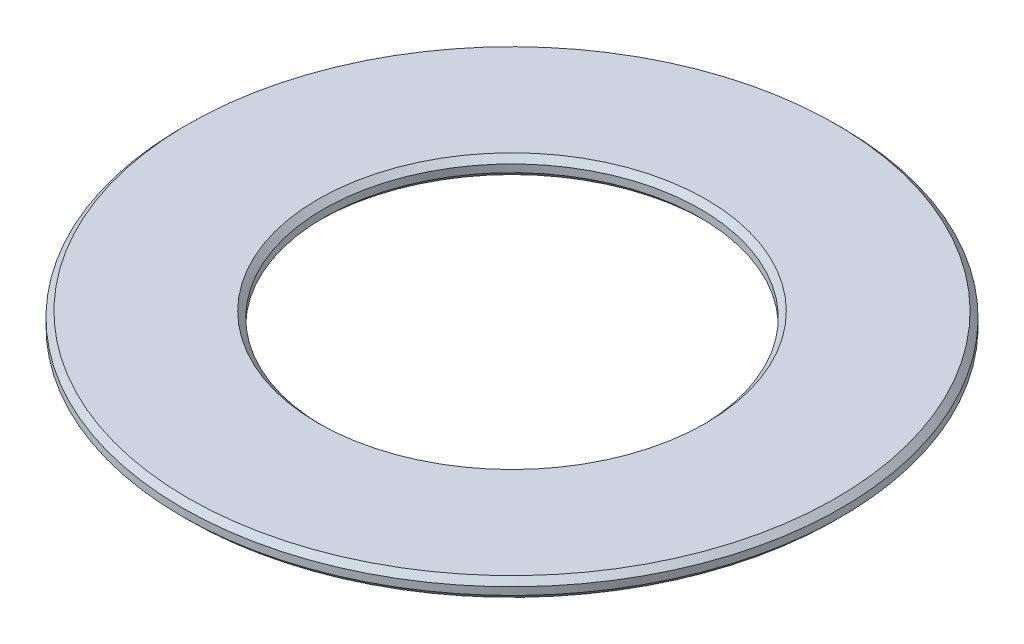
ISO-10303-21;
HEADER;
FILE_DESCRIPTION(('STEP AP214'),'2;1');
FILE_NAME('part.step','',(''),(''),'','','');
FILE_SCHEMA(('AUTOMOTIVE_DESIGN { 1 0 10303 214 1 1 1 1 }'));
ENDSEC;
DATA;
#1=APPLICATION_CONTEXT('core data for automotive mechanical design processes');
#2=APPLICATION_PROTOCOL_DEFINITION('international standard','automotive_design',2000,#1);
#3=PRODUCT_CONTEXT('',#1,'mechanical');
#4=PRODUCT('Part','Part','',(#3));
#5=PRODUCT_RELATED_PRODUCT_CATEGORY('part','',(#4));
#6=PRODUCT_DEFINITION_FORMATION('','',#4);
#7=PRODUCT_DEFINITION_CONTEXT('part definition',#1,'design');
#8=PRODUCT_DEFINITION('design','',#6,#7);
#9=PRODUCT_DEFINITION_SHAPE('','',#8);
#10=(LENGTH_UNIT() NAMED_UNIT(*) SI_UNIT(.MILLI.,.METRE.));
#11=(NAMED_UNIT(*) PLANE_ANGLE_UNIT() SI_UNIT($,.RADIAN.));
#12=(NAMED_UNIT(*) SI_UNIT($,.STERADIAN.) SOLID_ANGLE_UNIT());
#13=UNCERTAINTY_MEASURE_WITH_UNIT(LENGTH_MEASURE(1.E-05),#10,'distance_accuracy_value','');
#14=(GEOMETRIC_REPRESENTATION_CONTEXT(3) GLOBAL_UNCERTAINTY_ASSIGNED_CONTEXT((#13)) GLOBAL_UNIT_ASSIGNED_CONTEXT((#10,
#11,#12)) REPRESENTATION_CONTEXT('',''));
#15=CARTESIAN_POINT('',(0.,0.,0.));
#16=DIRECTION('',(0.,0.,1.));
#17=DIRECTION('',(1.,0.,0.));
#18=AXIS2_PLACEMENT_3D('',#15,#16,#17);
#19=CARTESIAN_POINT('',(0.,0.5,0.));
#20=DIRECTION('',(0.,1.,0.));
#21=DIRECTION('',(0.,0.,1.));
#22=AXIS2_PLACEMENT_3D('',#19,#20,#21);
#23=PLANE('',#22);
#24=CARTESIAN_POINT('',(0.,0.5,0.));
#25=DIRECTION('',(0.,1.,0.));
#26=DIRECTION('',(0.,0.,1.));
#27=AXIS2_PLACEMENT_3D('',#24,#25,#26);
#28=CIRCLE('',#27,17.2);
#29=CARTESIAN_POINT('',(0.,0.5,17.2));
#30=VERTEX_POINT('',#29);
#31=EDGE_CURVE('E40',#30,#30,#28,.T.);
#32=ORIENTED_EDGE('',*,*,#31,.T.);
#33=EDGE_LOOP('',(#32));
#34=FACE_BOUND('',#33,.T.);
#35=CARTESIAN_POINT('',(0.,0.5,0.));
#36=DIRECTION('',(0.,1.,0.));
#37=DIRECTION('',(0.,0.,1.));
#38=AXIS2_PLACEMENT_3D('',#35,#36,#37);
#39=CIRCLE('',#38,10.3);
#40=CARTESIAN_POINT('',(0.,0.5,10.3));
#41=VERTEX_POINT('',#40);
#42=EDGE_CURVE('E44',#41,#41,#39,.F.);
#43=ORIENTED_EDGE('',*,*,#42,.T.);
#44=EDGE_LOOP('',(#43));
#45=FACE_BOUND('',#44,.T.);
#46=ADVANCED_FACE('F29',(#34,#45),#23,.T.);
#47=CARTESIAN_POINT('',(0.,-0.5,0.));
#48=DIRECTION('',(0.,1.,0.));
#49=DIRECTION('',(0.,0.,1.));
#50=AXIS2_PLACEMENT_3D('',#47,#48,#49);
#51=PLANE('',#50);
#52=CARTESIAN_POINT('',(0.,-0.5,0.));
#53=DIRECTION('',(0.,1.,0.));
#54=DIRECTION('',(0.,0.,1.));
#55=AXIS2_PLACEMENT_3D('',#52,#53,#54);
#56=CIRCLE('',#55,17.2);
#57=CARTESIAN_POINT('',(0.,-0.5,17.2));
#58=VERTEX_POINT('',#57);
#59=EDGE_CURVE('E49',#58,#58,#56,.F.);
#60=ORIENTED_EDGE('',*,*,#59,.T.);
#61=EDGE_LOOP('',(#60));
#62=FACE_BOUND('',#61,.T.);
#63=CARTESIAN_POINT('',(0.,-0.5,0.));
#64=DIRECTION('',(0.,1.,0.));
#65=DIRECTION('',(0.,0.,1.));
#66=AXIS2_PLACEMENT_3D('',#63,#64,#65);
#67=CIRCLE('',#66,10.3);
#68=CARTESIAN_POINT('',(0.,-0.5,10.3));
#69=VERTEX_POINT('',#68);
#70=EDGE_CURVE('E52',#69,#69,#67,.T.);
#71=ORIENTED_EDGE('',*,*,#70,.T.);
#72=EDGE_LOOP('',(#71));
#73=FACE_BOUND('',#72,.T.);
#74=ADVANCED_FACE('F74',(#62,#73),#51,.F.);
#75=CARTESIAN_POINT('',(0.,0.5,0.));
#76=DIRECTION('',(0.,-1.,0.));
#77=DIRECTION('',(0.,0.,-1.));
#78=AXIS2_PLACEMENT_3D('',#75,#76,#77);
#79=CYLINDRICAL_SURFACE('',#78,17.5);
#80=CARTESIAN_POINT('',(0.,-0.200000000000005,0.));
#81=DIRECTION('',(0.,1.,0.));
#82=DIRECTION('',(0.,0.,1.));
#83=AXIS2_PLACEMENT_3D('',#80,#81,#82);
#84=CIRCLE('',#83,17.5);
#85=CARTESIAN_POINT('',(0.,-0.200000000000005,17.5));
#86=VERTEX_POINT('',#85);
#87=EDGE_CURVE('E55',#86,#86,#84,.T.);
#88=ORIENTED_EDGE('',*,*,#87,.T.);
#89=EDGE_LOOP('',(#88));
#90=FACE_BOUND('',#89,.T.);
#91=CARTESIAN_POINT('',(0.,0.199999999999998,0.));
#92=DIRECTION('',(0.,1.,0.));
#93=DIRECTION('',(0.,0.,1.));
#94=AXIS2_PLACEMENT_3D('',#91,#92,#93);
#95=CIRCLE('',#94,17.5);
#96=CARTESIAN_POINT('',(0.,0.199999999999998,17.5));
#97=VERTEX_POINT('',#96);
#98=EDGE_CURVE('E58',#97,#97,#95,.F.);
#99=ORIENTED_EDGE('',*,*,#98,.T.);
#100=EDGE_LOOP('',(#99));
#101=FACE_BOUND('',#100,.T.);
#102=ADVANCED_FACE('F62',(#90,#101),#79,.T.);
#103=CARTESIAN_POINT('',(0.,0.5,0.));
#104=DIRECTION('',(0.,-1.,0.));
#105=DIRECTION('',(0.,0.,-1.));
#106=AXIS2_PLACEMENT_3D('',#103,#104,#105);
#107=CYLINDRICAL_SURFACE('',#106,10.);
#108=CARTESIAN_POINT('',(0.,-0.199999999999998,0.));
#109=DIRECTION('',(0.,1.,0.));
#110=DIRECTION('',(0.,0.,1.));
#111=AXIS2_PLACEMENT_3D('',#108,#109,#110);
#112=CIRCLE('',#111,10.);
#113=CARTESIAN_POINT('',(0.,-0.199999999999998,10.));
#114=VERTEX_POINT('',#113);
#115=EDGE_CURVE('E10',#114,#114,#112,.F.);
#116=ORIENTED_EDGE('',*,*,#115,.T.);
#117=EDGE_LOOP('',(#116));
#118=FACE_BOUND('',#117,.T.);
#119=CARTESIAN_POINT('',(0.,0.2,0.));
#120=DIRECTION('',(0.,1.,0.));
#121=DIRECTION('',(0.,0.,1.));
#122=AXIS2_PLACEMENT_3D('',#119,#120,#121);
#123=CIRCLE('',#122,10.);
#124=CARTESIAN_POINT('',(0.,0.2,10.));
#125=VERTEX_POINT('',#124);
#126=EDGE_CURVE('E36',#125,#125,#123,.T.);
#127=ORIENTED_EDGE('',*,*,#126,.T.);
#128=EDGE_LOOP('',(#127));
#129=FACE_BOUND('',#128,.T.);
#130=ADVANCED_FACE('F90',(#118,#129),#107,.F.);
#131=CARTESIAN_POINT('',(0.,-0.200000000000005,0.));
#132=DIRECTION('',(0.,1.,0.));
#133=DIRECTION('',(0.,0.,1.));
#134=AXIS2_PLACEMENT_3D('',#131,#132,#133);
#135=CONICAL_SURFACE('',#134,17.5,0.785398163397454);
#136=ORIENTED_EDGE('',*,*,#59,.F.);
#137=EDGE_LOOP('',(#136));
#138=FACE_BOUND('',#137,.T.);
#139=ORIENTED_EDGE('',*,*,#87,.F.);
#140=EDGE_LOOP('',(#139));
#141=FACE_BOUND('',#140,.T.);
#142=ADVANCED_FACE('F68',(#138,#141),#135,.T.);
#143=CARTESIAN_POINT('',(0.,0.5,0.));
#144=DIRECTION('',(0.,-1.,0.));
#145=DIRECTION('',(0.,0.,-1.));
#146=AXIS2_PLACEMENT_3D('',#143,#144,#145);
#147=CONICAL_SURFACE('',#146,17.2,0.785398163397443);
#148=ORIENTED_EDGE('',*,*,#98,.F.);
#149=EDGE_LOOP('',(#148));
#150=FACE_BOUND('',#149,.T.);
#151=ORIENTED_EDGE('',*,*,#31,.F.);
#152=EDGE_LOOP('',(#151));
#153=FACE_BOUND('',#152,.T.);
#154=ADVANCED_FACE('F64',(#150,#153),#147,.T.);
#155=CARTESIAN_POINT('',(0.,-0.5,0.));
#156=DIRECTION('',(0.,-1.,0.));
#157=DIRECTION('',(0.,0.,-1.));
#158=AXIS2_PLACEMENT_3D('',#155,#156,#157);
#159=CONICAL_SURFACE('',#158,10.3,0.785398163397451);
#160=ORIENTED_EDGE('',*,*,#115,.F.);
#161=EDGE_LOOP('',(#160));
#162=FACE_BOUND('',#161,.T.);
#163=ORIENTED_EDGE('',*,*,#70,.F.);
#164=EDGE_LOOP('',(#163));
#165=FACE_BOUND('',#164,.T.);
#166=ADVANCED_FACE('F67',(#162,#165),#159,.F.);
#167=CARTESIAN_POINT('',(0.,0.2,0.));
#168=DIRECTION('',(0.,1.,0.));
#169=DIRECTION('',(0.,0.,1.));
#170=AXIS2_PLACEMENT_3D('',#167,#168,#169);
#171=CONICAL_SURFACE('',#170,10.,0.785398163397443);
#172=ORIENTED_EDGE('',*,*,#42,.F.);
#173=EDGE_LOOP('',(#172));
#174=FACE_BOUND('',#173,.T.);
#175=ORIENTED_EDGE('',*,*,#126,.F.);
#176=EDGE_LOOP('',(#175));
#177=FACE_BOUND('',#176,.T.);
#178=ADVANCED_FACE('F31',(#174,#177),#171,.F.);
#179=CLOSED_SHELL('',(#46,#74,#102,#130,#142,#154,#166,#178));
#180=MANIFOLD_SOLID_BREP('B2',#179);
#181=ADVANCED_BREP_SHAPE_REPRESENTATION('',(#18,#180),#14);
#182=SHAPE_DEFINITION_REPRESENTATION(#9,#181);
ENDSEC;
END-ISO-10303-21;
